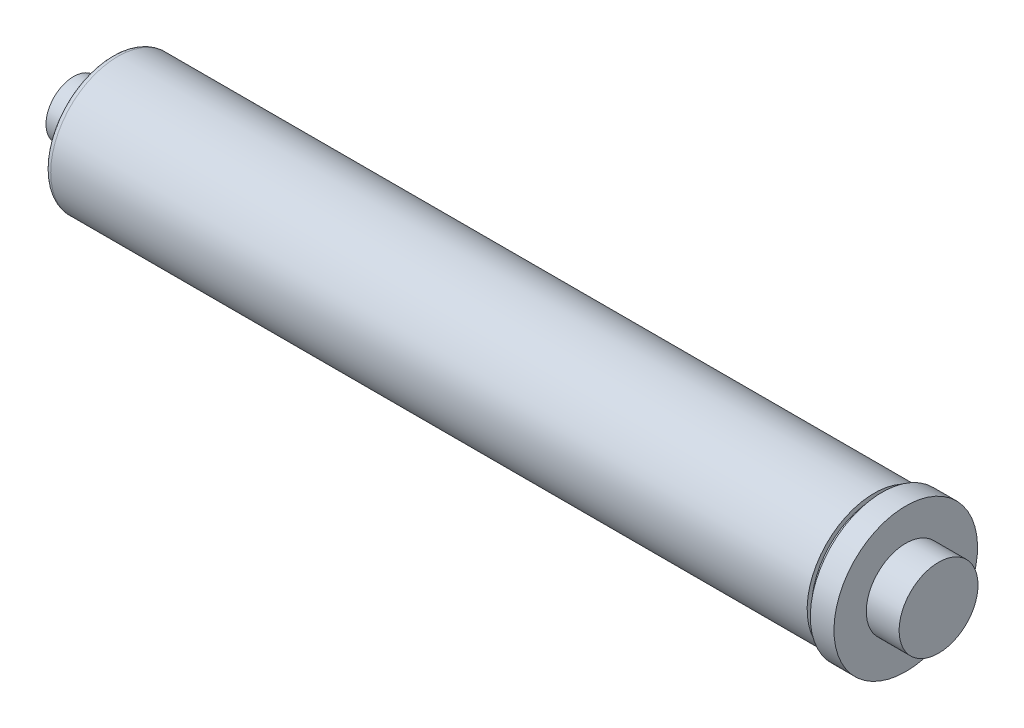
ISO-10303-21;
HEADER;
FILE_DESCRIPTION(('STEP AP214'),'2;1');
FILE_NAME('part.step','',(''),(''),'','','');
FILE_SCHEMA(('AUTOMOTIVE_DESIGN { 1 0 10303 214 1 1 1 1 }'));
ENDSEC;
DATA;
#1=APPLICATION_CONTEXT('core data for automotive mechanical design processes');
#2=APPLICATION_PROTOCOL_DEFINITION('international standard','automotive_design',2000,#1);
#3=PRODUCT_CONTEXT('',#1,'mechanical');
#4=PRODUCT('Part','Part','',(#3));
#5=PRODUCT_RELATED_PRODUCT_CATEGORY('part','',(#4));
#6=PRODUCT_DEFINITION_FORMATION('','',#4);
#7=PRODUCT_DEFINITION_CONTEXT('part definition',#1,'design');
#8=PRODUCT_DEFINITION('design','',#6,#7);
#9=PRODUCT_DEFINITION_SHAPE('','',#8);
#10=(LENGTH_UNIT() NAMED_UNIT(*) SI_UNIT(.MILLI.,.METRE.));
#11=(NAMED_UNIT(*) PLANE_ANGLE_UNIT() SI_UNIT($,.RADIAN.));
#12=(NAMED_UNIT(*) SI_UNIT($,.STERADIAN.) SOLID_ANGLE_UNIT());
#13=UNCERTAINTY_MEASURE_WITH_UNIT(LENGTH_MEASURE(1.E-05),#10,'distance_accuracy_value','');
#14=(GEOMETRIC_REPRESENTATION_CONTEXT(3) GLOBAL_UNCERTAINTY_ASSIGNED_CONTEXT((#13)) GLOBAL_UNIT_ASSIGNED_CONTEXT((#10,
#11,#12)) REPRESENTATION_CONTEXT('',''));
#15=CARTESIAN_POINT('',(0.,0.,0.));
#16=DIRECTION('',(0.,0.,1.));
#17=DIRECTION('',(1.,0.,0.));
#18=AXIS2_PLACEMENT_3D('',#15,#16,#17);
#19=CARTESIAN_POINT('',(0.,0.,0.));
#20=DIRECTION('',(1.,0.,0.));
#21=DIRECTION('',(0.,1.,0.));
#22=AXIS2_PLACEMENT_3D('',#19,#20,#21);
#23=PLANE('',#22);
#24=CARTESIAN_POINT('',(0.,0.,0.));
#25=DIRECTION('',(-1.,0.,0.));
#26=DIRECTION('',(0.,-1.,0.));
#27=AXIS2_PLACEMENT_3D('',#24,#25,#26);
#28=CIRCLE('',#27,7.9375);
#29=CARTESIAN_POINT('',(0.,-7.9375,0.));
#30=VERTEX_POINT('',#29);
#31=EDGE_CURVE('E94',#30,#30,#28,.T.);
#32=ORIENTED_EDGE('',*,*,#31,.F.);
#33=EDGE_LOOP('',(#32));
#34=FACE_BOUND('',#33,.T.);
#35=CARTESIAN_POINT('',(0.,0.,0.));
#36=DIRECTION('',(-1.,0.,0.));
#37=DIRECTION('',(0.,-1.,0.));
#38=AXIS2_PLACEMENT_3D('',#35,#36,#37);
#39=CIRCLE('',#38,11.1125);
#40=CARTESIAN_POINT('',(0.,-11.1125,0.));
#41=VERTEX_POINT('',#40);
#42=EDGE_CURVE('E54',#41,#41,#39,.T.);
#43=ORIENTED_EDGE('',*,*,#42,.T.);
#44=EDGE_LOOP('',(#43));
#45=FACE_BOUND('',#44,.T.);
#46=ADVANCED_FACE('F41',(#34,#45),#23,.F.);
#47=CARTESIAN_POINT('',(0.,0.,0.));
#48=DIRECTION('',(-1.,0.,0.));
#49=DIRECTION('',(0.,-1.,0.));
#50=AXIS2_PLACEMENT_3D('',#47,#48,#49);
#51=CYLINDRICAL_SURFACE('',#50,11.1125);
#52=ORIENTED_EDGE('',*,*,#42,.F.);
#53=EDGE_LOOP('',(#52));
#54=FACE_BOUND('',#53,.T.);
#55=CARTESIAN_POINT('',(15.24,0.,0.));
#56=DIRECTION('',(-1.,0.,0.));
#57=DIRECTION('',(0.,-1.,0.));
#58=AXIS2_PLACEMENT_3D('',#55,#56,#57);
#59=CIRCLE('',#58,11.1125);
#60=CARTESIAN_POINT('',(15.24,-11.1125,0.));
#61=VERTEX_POINT('',#60);
#62=EDGE_CURVE('E59',#61,#61,#59,.T.);
#63=ORIENTED_EDGE('',*,*,#62,.T.);
#64=EDGE_LOOP('',(#63));
#65=FACE_BOUND('',#64,.T.);
#66=ADVANCED_FACE('F132',(#54,#65),#51,.T.);
#67=CARTESIAN_POINT('',(15.24,11.1125,0.));
#68=DIRECTION('',(1.,0.,0.));
#69=DIRECTION('',(0.,1.,0.));
#70=AXIS2_PLACEMENT_3D('',#67,#68,#69);
#71=PLANE('',#70);
#72=CARTESIAN_POINT('',(15.24,0.,0.));
#73=DIRECTION('',(1.,0.,0.));
#74=DIRECTION('',(0.,1.,0.));
#75=AXIS2_PLACEMENT_3D('',#72,#73,#74);
#76=CIRCLE('',#75,24.4475);
#77=CARTESIAN_POINT('',(15.24,24.4475,0.));
#78=VERTEX_POINT('',#77);
#79=EDGE_CURVE('E49',#78,#78,#76,.F.);
#80=ORIENTED_EDGE('',*,*,#79,.T.);
#81=EDGE_LOOP('',(#80));
#82=FACE_BOUND('',#81,.T.);
#83=ORIENTED_EDGE('',*,*,#62,.F.);
#84=EDGE_LOOP('',(#83));
#85=FACE_BOUND('',#84,.T.);
#86=ADVANCED_FACE('F137',(#82,#85),#71,.F.);
#87=CARTESIAN_POINT('',(0.,0.,0.));
#88=DIRECTION('',(-1.,0.,0.));
#89=DIRECTION('',(0.,-1.,0.));
#90=AXIS2_PLACEMENT_3D('',#87,#88,#89);
#91=CYLINDRICAL_SURFACE('',#90,26.9875);
#92=CARTESIAN_POINT('',(17.78,0.,0.));
#93=DIRECTION('',(1.,0.,0.));
#94=DIRECTION('',(0.,1.,0.));
#95=AXIS2_PLACEMENT_3D('',#92,#93,#94);
#96=CIRCLE('',#95,26.9875);
#97=CARTESIAN_POINT('',(17.78,26.9875,0.));
#98=VERTEX_POINT('',#97);
#99=EDGE_CURVE('E10',#98,#98,#96,.T.);
#100=ORIENTED_EDGE('',*,*,#99,.T.);
#101=EDGE_LOOP('',(#100));
#102=FACE_BOUND('',#101,.T.);
#103=CARTESIAN_POINT('',(322.199,0.,0.));
#104=DIRECTION('',(-1.,0.,0.));
#105=DIRECTION('',(0.,-1.,0.));
#106=AXIS2_PLACEMENT_3D('',#103,#104,#105);
#107=CIRCLE('',#106,26.9875);
#108=CARTESIAN_POINT('',(322.199,-26.9875,0.));
#109=VERTEX_POINT('',#108);
#110=EDGE_CURVE('E65',#109,#109,#107,.T.);
#111=ORIENTED_EDGE('',*,*,#110,.T.);
#112=EDGE_LOOP('',(#111));
#113=FACE_BOUND('',#112,.T.);
#114=ADVANCED_FACE('F142',(#102,#113),#91,.T.);
#115=CARTESIAN_POINT('',(322.199,26.9875,0.));
#116=DIRECTION('',(-1.,0.,0.));
#117=DIRECTION('',(0.,-1.,0.));
#118=AXIS2_PLACEMENT_3D('',#115,#116,#117);
#119=PLANE('',#118);
#120=ORIENTED_EDGE('',*,*,#110,.F.);
#121=EDGE_LOOP('',(#120));
#122=FACE_BOUND('',#121,.T.);
#123=CARTESIAN_POINT('',(322.199,0.,0.));
#124=DIRECTION('',(-1.,0.,0.));
#125=DIRECTION('',(0.,-1.,0.));
#126=AXIS2_PLACEMENT_3D('',#123,#124,#125);
#127=CIRCLE('',#126,25.1714);
#128=CARTESIAN_POINT('',(322.199,-25.1714,0.));
#129=VERTEX_POINT('',#128);
#130=EDGE_CURVE('E69',#129,#129,#127,.T.);
#131=ORIENTED_EDGE('',*,*,#130,.T.);
#132=EDGE_LOOP('',(#131));
#133=FACE_BOUND('',#132,.T.);
#134=ADVANCED_FACE('F147',(#122,#133),#119,.F.);
#135=CARTESIAN_POINT('',(0.,0.,0.));
#136=DIRECTION('',(-1.,0.,0.));
#137=DIRECTION('',(0.,-1.,0.));
#138=AXIS2_PLACEMENT_3D('',#135,#136,#137);
#139=CYLINDRICAL_SURFACE('',#138,25.1714);
#140=ORIENTED_EDGE('',*,*,#130,.F.);
#141=EDGE_LOOP('',(#140));
#142=FACE_BOUND('',#141,.T.);
#143=CARTESIAN_POINT('',(325.374,0.,0.));
#144=DIRECTION('',(-1.,0.,0.));
#145=DIRECTION('',(0.,-1.,0.));
#146=AXIS2_PLACEMENT_3D('',#143,#144,#145);
#147=CIRCLE('',#146,25.1714);
#148=CARTESIAN_POINT('',(325.374,-25.1714,0.));
#149=VERTEX_POINT('',#148);
#150=EDGE_CURVE('E73',#149,#149,#147,.T.);
#151=ORIENTED_EDGE('',*,*,#150,.T.);
#152=EDGE_LOOP('',(#151));
#153=FACE_BOUND('',#152,.T.);
#154=ADVANCED_FACE('F152',(#142,#153),#139,.T.);
#155=CARTESIAN_POINT('',(325.374,25.1714,0.));
#156=DIRECTION('',(1.,0.,0.));
#157=DIRECTION('',(0.,1.,0.));
#158=AXIS2_PLACEMENT_3D('',#155,#156,#157);
#159=PLANE('',#158);
#160=ORIENTED_EDGE('',*,*,#150,.F.);
#161=EDGE_LOOP('',(#160));
#162=FACE_BOUND('',#161,.T.);
#163=CARTESIAN_POINT('',(325.374,0.,0.));
#164=DIRECTION('',(-1.,0.,0.));
#165=DIRECTION('',(0.,-1.,0.));
#166=AXIS2_PLACEMENT_3D('',#163,#164,#165);
#167=CIRCLE('',#166,28.8925);
#168=CARTESIAN_POINT('',(325.374,-28.8925000000001,0.));
#169=VERTEX_POINT('',#168);
#170=EDGE_CURVE('E77',#169,#169,#167,.T.);
#171=ORIENTED_EDGE('',*,*,#170,.T.);
#172=EDGE_LOOP('',(#171));
#173=FACE_BOUND('',#172,.T.);
#174=ADVANCED_FACE('F156',(#162,#173),#159,.F.);
#175=CARTESIAN_POINT('',(0.,0.,0.));
#176=DIRECTION('',(-1.,0.,0.));
#177=DIRECTION('',(0.,-1.,0.));
#178=AXIS2_PLACEMENT_3D('',#175,#176,#177);
#179=CYLINDRICAL_SURFACE('',#178,28.8925);
#180=ORIENTED_EDGE('',*,*,#170,.F.);
#181=EDGE_LOOP('',(#180));
#182=FACE_BOUND('',#181,.T.);
#183=CARTESIAN_POINT('',(334.899,0.,0.));
#184=DIRECTION('',(-1.,0.,0.));
#185=DIRECTION('',(0.,-1.,0.));
#186=AXIS2_PLACEMENT_3D('',#183,#184,#185);
#187=CIRCLE('',#186,28.8925);
#188=CARTESIAN_POINT('',(334.899,-28.8925000000001,0.));
#189=VERTEX_POINT('',#188);
#190=EDGE_CURVE('E81',#189,#189,#187,.T.);
#191=ORIENTED_EDGE('',*,*,#190,.T.);
#192=EDGE_LOOP('',(#191));
#193=FACE_BOUND('',#192,.T.);
#194=ADVANCED_FACE('F160',(#182,#193),#179,.T.);
#195=CARTESIAN_POINT('',(334.899,28.8925,0.));
#196=DIRECTION('',(-1.,0.,0.));
#197=DIRECTION('',(0.,-1.,0.));
#198=AXIS2_PLACEMENT_3D('',#195,#196,#197);
#199=PLANE('',#198);
#200=ORIENTED_EDGE('',*,*,#190,.F.);
#201=EDGE_LOOP('',(#200));
#202=FACE_BOUND('',#201,.T.);
#203=CARTESIAN_POINT('',(334.899,0.,0.));
#204=DIRECTION('',(-1.,0.,0.));
#205=DIRECTION('',(0.,-1.,0.));
#206=AXIS2_PLACEMENT_3D('',#203,#204,#205);
#207=CIRCLE('',#206,15.875);
#208=CARTESIAN_POINT('',(334.899,-15.875,0.));
#209=VERTEX_POINT('',#208);
#210=EDGE_CURVE('E85',#209,#209,#207,.T.);
#211=ORIENTED_EDGE('',*,*,#210,.T.);
#212=EDGE_LOOP('',(#211));
#213=FACE_BOUND('',#212,.T.);
#214=ADVANCED_FACE('F164',(#202,#213),#199,.F.);
#215=CARTESIAN_POINT('',(0.,0.,0.));
#216=DIRECTION('',(-1.,0.,0.));
#217=DIRECTION('',(0.,-1.,0.));
#218=AXIS2_PLACEMENT_3D('',#215,#216,#217);
#219=CYLINDRICAL_SURFACE('',#218,15.875);
#220=ORIENTED_EDGE('',*,*,#210,.F.);
#221=EDGE_LOOP('',(#220));
#222=FACE_BOUND('',#221,.T.);
#223=CARTESIAN_POINT('',(348.107,0.,0.));
#224=DIRECTION('',(-1.,0.,0.));
#225=DIRECTION('',(0.,-1.,0.));
#226=AXIS2_PLACEMENT_3D('',#223,#224,#225);
#227=CIRCLE('',#226,15.875);
#228=CARTESIAN_POINT('',(348.107,-15.875,0.));
#229=VERTEX_POINT('',#228);
#230=EDGE_CURVE('E89',#229,#229,#227,.T.);
#231=ORIENTED_EDGE('',*,*,#230,.T.);
#232=EDGE_LOOP('',(#231));
#233=FACE_BOUND('',#232,.T.);
#234=ADVANCED_FACE('F168',(#222,#233),#219,.T.);
#235=CARTESIAN_POINT('',(348.107,15.875,0.));
#236=DIRECTION('',(-1.,0.,0.));
#237=DIRECTION('',(0.,-1.,0.));
#238=AXIS2_PLACEMENT_3D('',#235,#236,#237);
#239=PLANE('',#238);
#240=ORIENTED_EDGE('',*,*,#230,.F.);
#241=EDGE_LOOP('',(#240));
#242=FACE_BOUND('',#241,.T.);
#243=ADVANCED_FACE('F172',(#242),#239,.F.);
#244=CARTESIAN_POINT('',(17.78,0.,0.));
#245=DIRECTION('',(1.,0.,0.));
#246=DIRECTION('',(0.,1.,0.));
#247=AXIS2_PLACEMENT_3D('',#244,#245,#246);
#248=TOROIDAL_SURFACE('',#247,24.4475,2.54);
#249=ORIENTED_EDGE('',*,*,#99,.F.);
#250=EDGE_LOOP('',(#249));
#251=FACE_BOUND('',#250,.T.);
#252=ORIENTED_EDGE('',*,*,#79,.F.);
#253=EDGE_LOOP('',(#252));
#254=FACE_BOUND('',#253,.T.);
#255=ADVANCED_FACE('F43',(#251,#254),#248,.T.);
#256=CARTESIAN_POINT('',(6.35,0.,0.));
#257=DIRECTION('',(-1.,0.,0.));
#258=DIRECTION('',(0.,-1.,0.));
#259=AXIS2_PLACEMENT_3D('',#256,#257,#258);
#260=CYLINDRICAL_SURFACE('',#259,7.9375);
#261=CARTESIAN_POINT('',(6.35,0.,0.));
#262=DIRECTION('',(-1.,0.,0.));
#263=DIRECTION('',(0.,-1.,0.));
#264=AXIS2_PLACEMENT_3D('',#261,#262,#263);
#265=CIRCLE('',#264,7.9375);
#266=CARTESIAN_POINT('',(6.35,-7.9375,0.));
#267=VERTEX_POINT('',#266);
#268=EDGE_CURVE('E93',#267,#267,#265,.T.);
#269=ORIENTED_EDGE('',*,*,#268,.F.);
#270=EDGE_LOOP('',(#269));
#271=FACE_BOUND('',#270,.T.);
#272=ORIENTED_EDGE('',*,*,#31,.T.);
#273=EDGE_LOOP('',(#272));
#274=FACE_BOUND('',#273,.T.);
#275=ADVANCED_FACE('F121',(#271,#274),#260,.F.);
#276=CARTESIAN_POINT('',(6.35,0.,0.));
#277=DIRECTION('',(-1.,0.,0.));
#278=DIRECTION('',(0.,-1.,0.));
#279=AXIS2_PLACEMENT_3D('',#276,#277,#278);
#280=PLANE('',#279);
#281=CARTESIAN_POINT('',(6.35,0.,0.));
#282=DIRECTION('',(-1.,0.,0.));
#283=DIRECTION('',(0.,-1.,0.));
#284=AXIS2_PLACEMENT_3D('',#281,#282,#283);
#285=CIRCLE('',#284,1.5875);
#286=CARTESIAN_POINT('',(6.35,-1.5875,0.));
#287=VERTEX_POINT('',#286);
#288=EDGE_CURVE('E102',#287,#287,#285,.T.);
#289=ORIENTED_EDGE('',*,*,#288,.F.);
#290=EDGE_LOOP('',(#289));
#291=FACE_BOUND('',#290,.T.);
#292=ORIENTED_EDGE('',*,*,#268,.T.);
#293=EDGE_LOOP('',(#292));
#294=FACE_BOUND('',#293,.T.);
#295=ADVANCED_FACE('F115',(#291,#294),#280,.T.);
#296=CARTESIAN_POINT('',(12.7,0.,0.));
#297=DIRECTION('',(-1.,0.,0.));
#298=DIRECTION('',(0.,-1.,0.));
#299=AXIS2_PLACEMENT_3D('',#296,#297,#298);
#300=CYLINDRICAL_SURFACE('',#299,1.5875);
#301=CARTESIAN_POINT('',(12.7,0.,0.));
#302=DIRECTION('',(-1.,0.,0.));
#303=DIRECTION('',(0.,-1.,0.));
#304=AXIS2_PLACEMENT_3D('',#301,#302,#303);
#305=CIRCLE('',#304,1.5875);
#306=CARTESIAN_POINT('',(12.7,-1.5875,0.));
#307=VERTEX_POINT('',#306);
#308=EDGE_CURVE('E98',#307,#307,#305,.T.);
#309=ORIENTED_EDGE('',*,*,#308,.F.);
#310=EDGE_LOOP('',(#309));
#311=FACE_BOUND('',#310,.T.);
#312=ORIENTED_EDGE('',*,*,#288,.T.);
#313=EDGE_LOOP('',(#312));
#314=FACE_BOUND('',#313,.T.);
#315=ADVANCED_FACE('F112',(#311,#314),#300,.F.);
#316=CARTESIAN_POINT('',(12.7,0.,0.));
#317=DIRECTION('',(-1.,0.,0.));
#318=DIRECTION('',(0.,-1.,0.));
#319=AXIS2_PLACEMENT_3D('',#316,#317,#318);
#320=PLANE('',#319);
#321=ORIENTED_EDGE('',*,*,#308,.T.);
#322=EDGE_LOOP('',(#321));
#323=FACE_BOUND('',#322,.T.);
#324=ADVANCED_FACE('F110',(#323),#320,.T.);
#325=CLOSED_SHELL('',(#46,#66,#86,#114,#134,#154,#174,#194,#214,#234,#243,#255,#275,#295,#315,#324));
#326=MANIFOLD_SOLID_BREP('B2',#325);
#327=ADVANCED_BREP_SHAPE_REPRESENTATION('',(#18,#326),#14);
#328=SHAPE_DEFINITION_REPRESENTATION(#9,#327);
ENDSEC;
END-ISO-10303-21;
